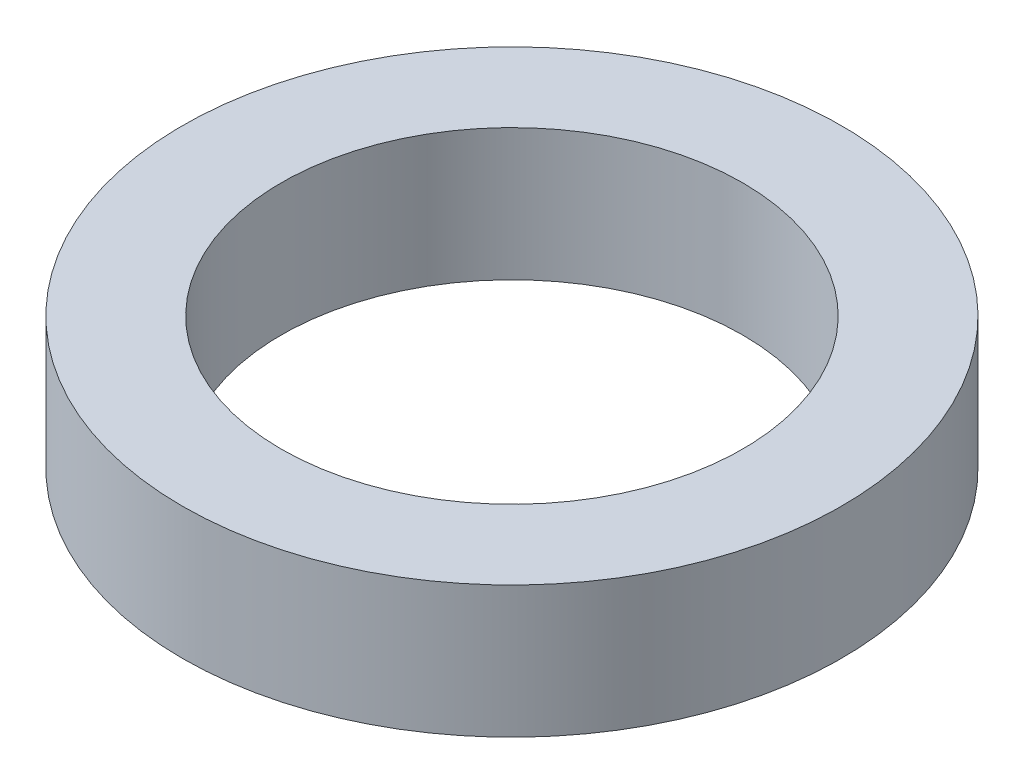
ISO-10303-21;
HEADER;
FILE_DESCRIPTION(('STEP AP214'),'2;1');
FILE_NAME('part.step','',(''),(''),'','','');
FILE_SCHEMA(('AUTOMOTIVE_DESIGN { 1 0 10303 214 1 1 1 1 }'));
ENDSEC;
DATA;
#1=APPLICATION_CONTEXT('core data for automotive mechanical design processes');
#2=APPLICATION_PROTOCOL_DEFINITION('international standard','automotive_design',2000,#1);
#3=PRODUCT_CONTEXT('',#1,'mechanical');
#4=PRODUCT('Part','Part','',(#3));
#5=PRODUCT_RELATED_PRODUCT_CATEGORY('part','',(#4));
#6=PRODUCT_DEFINITION_FORMATION('','',#4);
#7=PRODUCT_DEFINITION_CONTEXT('part definition',#1,'design');
#8=PRODUCT_DEFINITION('design','',#6,#7);
#9=PRODUCT_DEFINITION_SHAPE('','',#8);
#10=(LENGTH_UNIT() NAMED_UNIT(*) SI_UNIT(.MILLI.,.METRE.));
#11=(NAMED_UNIT(*) PLANE_ANGLE_UNIT() SI_UNIT($,.RADIAN.));
#12=(NAMED_UNIT(*) SI_UNIT($,.STERADIAN.) SOLID_ANGLE_UNIT());
#13=UNCERTAINTY_MEASURE_WITH_UNIT(LENGTH_MEASURE(1.E-05),#10,'distance_accuracy_value','');
#14=(GEOMETRIC_REPRESENTATION_CONTEXT(3) GLOBAL_UNCERTAINTY_ASSIGNED_CONTEXT((#13)) GLOBAL_UNIT_ASSIGNED_CONTEXT((#10,
#11,#12)) REPRESENTATION_CONTEXT('',''));
#15=CARTESIAN_POINT('',(0.,0.,0.));
#16=DIRECTION('',(0.,0.,1.));
#17=DIRECTION('',(1.,0.,0.));
#18=AXIS2_PLACEMENT_3D('',#15,#16,#17);
#19=CARTESIAN_POINT('',(0.,10.,0.));
#20=DIRECTION('',(0.,1.,0.));
#21=DIRECTION('',(0.,0.,1.));
#22=AXIS2_PLACEMENT_3D('',#19,#20,#21);
#23=PLANE('',#22);
#24=CARTESIAN_POINT('',(0.,10.,0.));
#25=DIRECTION('',(0.,1.,0.));
#26=DIRECTION('',(0.,0.,1.));
#27=AXIS2_PLACEMENT_3D('',#24,#25,#26);
#28=CIRCLE('',#27,25.);
#29=CARTESIAN_POINT('',(0.,10.,25.));
#30=VERTEX_POINT('',#29);
#31=EDGE_CURVE('E10',#30,#30,#28,.T.);
#32=ORIENTED_EDGE('',*,*,#31,.T.);
#33=EDGE_LOOP('',(#32));
#34=FACE_BOUND('',#33,.T.);
#35=CARTESIAN_POINT('',(0.,10.,0.));
#36=DIRECTION('',(0.,1.,0.));
#37=DIRECTION('',(0.,0.,1.));
#38=AXIS2_PLACEMENT_3D('',#35,#36,#37);
#39=CIRCLE('',#38,17.5);
#40=CARTESIAN_POINT('',(0.,10.,17.5));
#41=VERTEX_POINT('',#40);
#42=EDGE_CURVE('E42',#41,#41,#39,.T.);
#43=ORIENTED_EDGE('',*,*,#42,.F.);
#44=EDGE_LOOP('',(#43));
#45=FACE_BOUND('',#44,.T.);
#46=ADVANCED_FACE('F31',(#34,#45),#23,.T.);
#47=CARTESIAN_POINT('',(0.,0.,0.));
#48=DIRECTION('',(0.,1.,0.));
#49=DIRECTION('',(0.,0.,1.));
#50=AXIS2_PLACEMENT_3D('',#47,#48,#49);
#51=PLANE('',#50);
#52=CARTESIAN_POINT('',(0.,0.,0.));
#53=DIRECTION('',(0.,1.,0.));
#54=DIRECTION('',(0.,0.,1.));
#55=AXIS2_PLACEMENT_3D('',#52,#53,#54);
#56=CIRCLE('',#55,25.);
#57=CARTESIAN_POINT('',(0.,0.,25.));
#58=VERTEX_POINT('',#57);
#59=EDGE_CURVE('E35',#58,#58,#56,.T.);
#60=ORIENTED_EDGE('',*,*,#59,.F.);
#61=EDGE_LOOP('',(#60));
#62=FACE_BOUND('',#61,.T.);
#63=CARTESIAN_POINT('',(0.,0.,0.));
#64=DIRECTION('',(0.,1.,0.));
#65=DIRECTION('',(0.,0.,1.));
#66=AXIS2_PLACEMENT_3D('',#63,#64,#65);
#67=CIRCLE('',#66,17.5);
#68=CARTESIAN_POINT('',(0.,0.,17.5));
#69=VERTEX_POINT('',#68);
#70=EDGE_CURVE('E44',#69,#69,#67,.T.);
#71=ORIENTED_EDGE('',*,*,#70,.T.);
#72=EDGE_LOOP('',(#71));
#73=FACE_BOUND('',#72,.T.);
#74=ADVANCED_FACE('F54',(#62,#73),#51,.F.);
#75=CARTESIAN_POINT('',(0.,10.,0.));
#76=DIRECTION('',(0.,-1.,0.));
#77=DIRECTION('',(0.,0.,-1.));
#78=AXIS2_PLACEMENT_3D('',#75,#76,#77);
#79=CYLINDRICAL_SURFACE('',#78,25.);
#80=ORIENTED_EDGE('',*,*,#31,.F.);
#81=EDGE_LOOP('',(#80));
#82=FACE_BOUND('',#81,.T.);
#83=ORIENTED_EDGE('',*,*,#59,.T.);
#84=EDGE_LOOP('',(#83));
#85=FACE_BOUND('',#84,.T.);
#86=ADVANCED_FACE('F33',(#82,#85),#79,.T.);
#87=CARTESIAN_POINT('',(0.,10.,0.));
#88=DIRECTION('',(0.,-1.,0.));
#89=DIRECTION('',(0.,0.,-1.));
#90=AXIS2_PLACEMENT_3D('',#87,#88,#89);
#91=CYLINDRICAL_SURFACE('',#90,17.5);
#92=ORIENTED_EDGE('',*,*,#42,.T.);
#93=EDGE_LOOP('',(#92));
#94=FACE_BOUND('',#93,.T.);
#95=ORIENTED_EDGE('',*,*,#70,.F.);
#96=EDGE_LOOP('',(#95));
#97=FACE_BOUND('',#96,.T.);
#98=ADVANCED_FACE('F50',(#94,#97),#91,.F.);
#99=CLOSED_SHELL('',(#46,#74,#86,#98));
#100=MANIFOLD_SOLID_BREP('B2',#99);
#101=ADVANCED_BREP_SHAPE_REPRESENTATION('',(#18,#100),#14);
#102=SHAPE_DEFINITION_REPRESENTATION(#9,#101);
ENDSEC;
END-ISO-10303-21;
